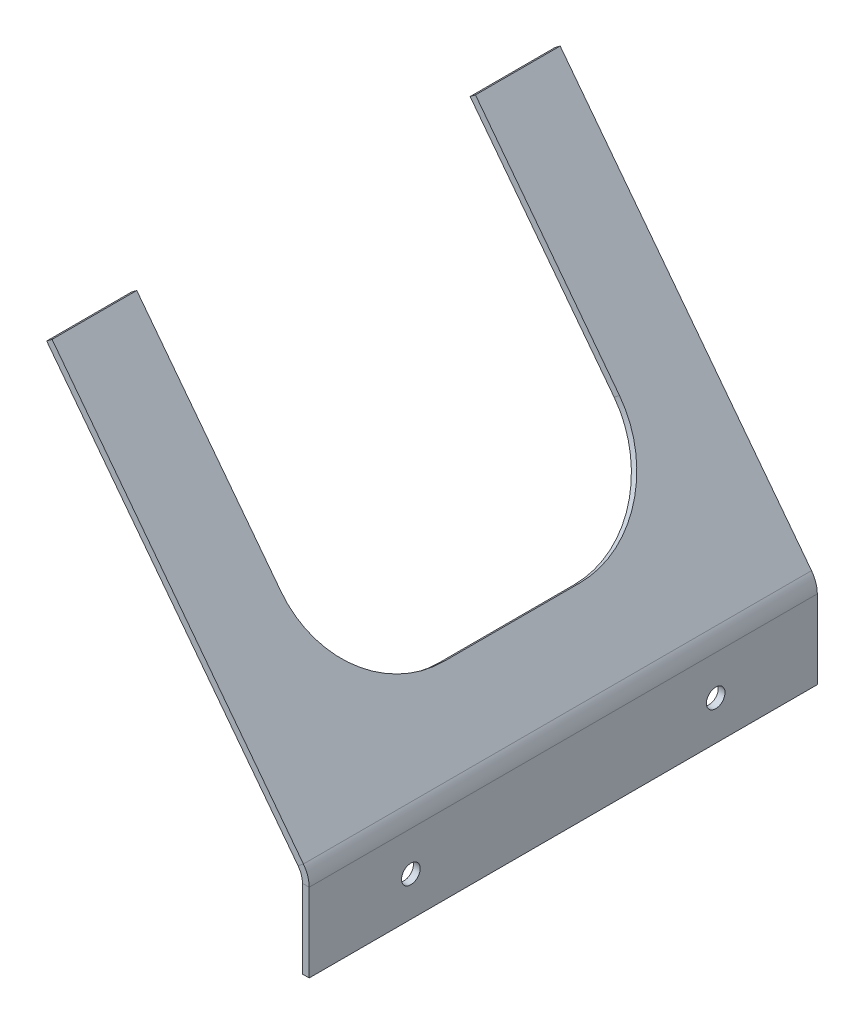
ISO-10303-21;
HEADER;
FILE_DESCRIPTION(('STEP AP214'),'2;1');
FILE_NAME('part.step','',(''),(''),'','','');
FILE_SCHEMA(('AUTOMOTIVE_DESIGN { 1 0 10303 214 1 1 1 1 }'));
ENDSEC;
DATA;
#1=APPLICATION_CONTEXT('core data for automotive mechanical design processes');
#2=APPLICATION_PROTOCOL_DEFINITION('international standard','automotive_design',2000,#1);
#3=PRODUCT_CONTEXT('',#1,'mechanical');
#4=PRODUCT('Part','Part','',(#3));
#5=PRODUCT_RELATED_PRODUCT_CATEGORY('part','',(#4));
#6=PRODUCT_DEFINITION_FORMATION('','',#4);
#7=PRODUCT_DEFINITION_CONTEXT('part definition',#1,'design');
#8=PRODUCT_DEFINITION('design','',#6,#7);
#9=PRODUCT_DEFINITION_SHAPE('','',#8);
#10=(LENGTH_UNIT() NAMED_UNIT(*) SI_UNIT(.MILLI.,.METRE.));
#11=(NAMED_UNIT(*) PLANE_ANGLE_UNIT() SI_UNIT($,.RADIAN.));
#12=(NAMED_UNIT(*) SI_UNIT($,.STERADIAN.) SOLID_ANGLE_UNIT());
#13=UNCERTAINTY_MEASURE_WITH_UNIT(LENGTH_MEASURE(1.E-05),#10,'distance_accuracy_value','');
#14=(GEOMETRIC_REPRESENTATION_CONTEXT(3) GLOBAL_UNCERTAINTY_ASSIGNED_CONTEXT((#13)) GLOBAL_UNIT_ASSIGNED_CONTEXT((#10,
#11,#12)) REPRESENTATION_CONTEXT('',''));
#15=CARTESIAN_POINT('',(0.,0.,0.));
#16=DIRECTION('',(0.,0.,1.));
#17=DIRECTION('',(1.,0.,0.));
#18=AXIS2_PLACEMENT_3D('',#15,#16,#17);
#19=CARTESIAN_POINT('',(1013.55842698651,-572.924346037237,55.));
#20=DIRECTION('',(-0.794371424617198,-0.607432333475626,0.));
#21=DIRECTION('',(0.607432333475626,-0.794371424617198,0.));
#22=AXIS2_PLACEMENT_3D('',#19,#20,#21);
#23=CYLINDRICAL_SURFACE('',#22,30.);
#24=DIRECTION('',(0.794371424617198,0.607432333475626,0.));
#25=VECTOR('',#24,1.);
#26=CARTESIAN_POINT('',(1013.55842698651,-572.924346037237,25.));
#27=LINE('',#26,#25);
#28=CARTESIAN_POINT('',(1005.61471274034,-578.998669371993,25.));
#29=VERTEX_POINT('',#28);
#30=CARTESIAN_POINT('',(1007.20345558957,-577.783804705042,25.));
#31=VERTEX_POINT('',#30);
#32=EDGE_CURVE('E192',#29,#31,#27,.T.);
#33=ORIENTED_EDGE('',*,*,#32,.F.);
#34=CARTESIAN_POINT('',(1005.61471274034,-578.998669371993,55.));
#35=DIRECTION('',(-0.794371424617198,-0.607432333475626,0.));
#36=DIRECTION('',(0.607432333475626,-0.794371424617198,0.));
#37=AXIS2_PLACEMENT_3D('',#34,#35,#36);
#38=CIRCLE('',#37,30.);
#39=CARTESIAN_POINT('',(1023.8376827446,-602.829812110509,55.));
#40=VERTEX_POINT('',#39);
#41=EDGE_CURVE('E48',#29,#40,#38,.T.);
#42=ORIENTED_EDGE('',*,*,#41,.T.);
#43=DIRECTION('',(0.794371424617198,0.607432333475626,0.));
#44=VECTOR('',#43,1.);
#45=CARTESIAN_POINT('',(1031.78139699078,-596.755488775753,55.));
#46=LINE('',#45,#44);
#47=CARTESIAN_POINT('',(1025.42642559384,-601.614947443558,55.));
#48=VERTEX_POINT('',#47);
#49=EDGE_CURVE('E195',#48,#40,#46,.F.);
#50=ORIENTED_EDGE('',*,*,#49,.F.);
#51=CARTESIAN_POINT('',(1007.20345558957,-577.783804705042,55.));
#52=DIRECTION('',(-0.794371424617198,-0.607432333475626,0.));
#53=DIRECTION('',(0.607432333475626,-0.794371424617198,0.));
#54=AXIS2_PLACEMENT_3D('',#51,#52,#53);
#55=CIRCLE('',#54,30.);
#56=EDGE_CURVE('E12',#48,#31,#55,.F.);
#57=ORIENTED_EDGE('',*,*,#56,.T.);
#58=EDGE_LOOP('',(#33,#42,#50,#57));
#59=FACE_BOUND('',#58,.T.);
#60=ADVANCED_FACE('F41',(#59),#23,.F.);
#61=CARTESIAN_POINT('',(1013.55842698651,-572.924346037237,95.));
#62=DIRECTION('',(0.794371424617198,0.607432333475626,0.));
#63=DIRECTION('',(-0.607432333475626,0.794371424617198,0.));
#64=AXIS2_PLACEMENT_3D('',#61,#62,#63);
#65=CYLINDRICAL_SURFACE('',#64,30.);
#66=DIRECTION('',(-0.794371424617198,-0.607432333475626,0.));
#67=VECTOR('',#66,1.);
#68=CARTESIAN_POINT('',(1013.55842698651,-572.924346037237,125.));
#69=LINE('',#68,#67);
#70=CARTESIAN_POINT('',(1007.20345558957,-577.783804705042,125.));
#71=VERTEX_POINT('',#70);
#72=CARTESIAN_POINT('',(1005.61471274034,-578.998669371993,125.));
#73=VERTEX_POINT('',#72);
#74=EDGE_CURVE('E146',#71,#73,#69,.T.);
#75=ORIENTED_EDGE('',*,*,#74,.F.);
#76=CARTESIAN_POINT('',(1007.20345558957,-577.783804705042,95.));
#77=DIRECTION('',(-0.794371424617198,-0.607432333475626,0.));
#78=DIRECTION('',(0.607432333475626,-0.794371424617198,0.));
#79=AXIS2_PLACEMENT_3D('',#76,#77,#78);
#80=CIRCLE('',#79,30.);
#81=CARTESIAN_POINT('',(1025.42642559384,-601.614947443558,95.));
#82=VERTEX_POINT('',#81);
#83=EDGE_CURVE('E187',#71,#82,#80,.F.);
#84=ORIENTED_EDGE('',*,*,#83,.T.);
#85=DIRECTION('',(-0.794371424617198,-0.607432333475626,0.));
#86=VECTOR('',#85,1.);
#87=CARTESIAN_POINT('',(1031.78139699078,-596.755488775753,95.));
#88=LINE('',#87,#86);
#89=CARTESIAN_POINT('',(1023.8376827446,-602.829812110509,95.));
#90=VERTEX_POINT('',#89);
#91=EDGE_CURVE('E184',#90,#82,#88,.F.);
#92=ORIENTED_EDGE('',*,*,#91,.F.);
#93=CARTESIAN_POINT('',(1005.61471274034,-578.998669371993,95.));
#94=DIRECTION('',(-0.794371424617198,-0.607432333475626,0.));
#95=DIRECTION('',(0.607432333475626,-0.794371424617198,0.));
#96=AXIS2_PLACEMENT_3D('',#93,#94,#95);
#97=CIRCLE('',#96,30.);
#98=EDGE_CURVE('E190',#90,#73,#97,.T.);
#99=ORIENTED_EDGE('',*,*,#98,.T.);
#100=EDGE_LOOP('',(#75,#84,#92,#99));
#101=FACE_BOUND('',#100,.T.);
#102=ADVANCED_FACE('F319',(#101),#65,.F.);
#103=CARTESIAN_POINT('',(963.094449397042,-523.392669648789,150.));
#104=DIRECTION('',(-0.607432333475586,0.794371424617228,0.));
#105=DIRECTION('',(-0.794371424617228,-0.607432333475586,0.));
#106=AXIS2_PLACEMENT_3D('',#103,#104,#105);
#107=PLANE('',#106);
#108=DIRECTION('',(-0.794371424617198,-0.607432333475626,0.));
#109=VECTOR('',#108,1.);
#110=CARTESIAN_POINT('',(971.038163643214,-517.318346314033,125.));
#111=LINE('',#110,#109);
#112=CARTESIAN_POINT('',(964.683192246277,-522.177804981838,125.));
#113=VERTEX_POINT('',#112);
#114=CARTESIAN_POINT('',(963.094449397042,-523.392669648789,125.));
#115=VERTEX_POINT('',#114);
#116=EDGE_CURVE('E143',#113,#115,#111,.T.);
#117=ORIENTED_EDGE('',*,*,#116,.T.);
#118=DIRECTION('',(0.,0.,-1.));
#119=VECTOR('',#118,1.);
#120=CARTESIAN_POINT('',(963.094449397042,-523.392669648789,150.));
#121=LINE('',#120,#119);
#122=CARTESIAN_POINT('',(963.094449397042,-523.392669648789,150.));
#123=VERTEX_POINT('',#122);
#124=EDGE_CURVE('E156',#123,#115,#121,.T.);
#125=ORIENTED_EDGE('',*,*,#124,.F.);
#126=DIRECTION('',(0.794371424617228,0.607432333475586,0.));
#127=VECTOR('',#126,1.);
#128=CARTESIAN_POINT('',(963.094449397042,-523.392669648789,150.));
#129=LINE('',#128,#127);
#130=CARTESIAN_POINT('',(964.683192246277,-522.177804981838,150.));
#131=VERTEX_POINT('',#130);
#132=EDGE_CURVE('E218',#123,#131,#129,.T.);
#133=ORIENTED_EDGE('',*,*,#132,.T.);
#134=DIRECTION('',(0.,0.,-1.));
#135=VECTOR('',#134,1.);
#136=CARTESIAN_POINT('',(964.683192246277,-522.177804981838,150.));
#137=LINE('',#136,#135);
#138=EDGE_CURVE('E159',#131,#113,#137,.T.);
#139=ORIENTED_EDGE('',*,*,#138,.T.);
#140=EDGE_LOOP('',(#117,#125,#133,#139));
#141=FACE_BOUND('',#140,.T.);
#142=ADVANCED_FACE('F154',(#141),#107,.T.);
#143=CARTESIAN_POINT('',(1037.29425854632,-620.427688780842,150.));
#144=DIRECTION('',(0.,0.,1.));
#145=DIRECTION('',(1.,0.,0.));
#146=AXIS2_PLACEMENT_3D('',#143,#144,#145);
#147=PLANE('',#146);
#148=DIRECTION('',(0.794371424617228,0.607432333475586,0.));
#149=VECTOR('',#148,1.);
#150=CARTESIAN_POINT('',(1037.29425854632,-620.427688780842,150.));
#151=LINE('',#150,#149);
#152=CARTESIAN_POINT('',(1037.29425854632,-620.427688780842,150.));
#153=VERTEX_POINT('',#152);
#154=CARTESIAN_POINT('',(1038.88300139555,-619.212824113891,150.));
#155=VERTEX_POINT('',#154);
#156=EDGE_CURVE('E181',#153,#155,#151,.T.);
#157=ORIENTED_EDGE('',*,*,#156,.F.);
#158=CARTESIAN_POINT('',(1032.25,-624.284884098413,150.));
#159=DIRECTION('',(0.,0.,-1.));
#160=DIRECTION('',(-1.,0.,0.));
#161=AXIS2_PLACEMENT_3D('',#158,#159,#160);
#162=CIRCLE('',#161,6.35);
#163=CARTESIAN_POINT('',(1038.6,-624.284884098413,150.));
#164=VERTEX_POINT('',#163);
#165=EDGE_CURVE('E222',#164,#153,#162,.F.);
#166=ORIENTED_EDGE('',*,*,#165,.F.);
#167=DIRECTION('',(-1.,0.,0.));
#168=VECTOR('',#167,1.);
#169=CARTESIAN_POINT('',(1040.6,-624.284884098413,150.));
#170=LINE('',#169,#168);
#171=CARTESIAN_POINT('',(1040.6,-624.284884098413,150.));
#172=VERTEX_POINT('',#171);
#173=EDGE_CURVE('E179',#172,#164,#170,.T.);
#174=ORIENTED_EDGE('',*,*,#173,.F.);
#175=CARTESIAN_POINT('',(1032.25,-624.284884098413,150.));
#176=DIRECTION('',(0.,0.,1.));
#177=DIRECTION('',(1.,0.,0.));
#178=AXIS2_PLACEMENT_3D('',#175,#176,#177);
#179=CIRCLE('',#178,8.35);
#180=EDGE_CURVE('E234',#172,#155,#179,.T.);
#181=ORIENTED_EDGE('',*,*,#180,.T.);
#182=EDGE_LOOP('',(#157,#166,#174,#181));
#183=FACE_BOUND('',#182,.T.);
#184=ADVANCED_FACE('F299',(#183),#147,.T.);
#185=CARTESIAN_POINT('',(1040.6,-624.284884098413,150.));
#186=DIRECTION('',(0.,0.,1.));
#187=DIRECTION('',(1.,0.,0.));
#188=AXIS2_PLACEMENT_3D('',#185,#186,#187);
#189=PLANE('',#188);
#190=DIRECTION('',(-0.607432333475626,0.794371424617198,0.));
#191=VECTOR('',#190,1.);
#192=CARTESIAN_POINT('',(1038.6,-622.135276015798,150.));
#193=LINE('',#192,#191);
#194=EDGE_CURVE('E166',#153,#123,#193,.T.);
#195=ORIENTED_EDGE('',*,*,#194,.F.);
#196=ORIENTED_EDGE('',*,*,#156,.T.);
#197=DIRECTION('',(-0.607432333475626,0.794371424617198,0.));
#198=VECTOR('',#197,1.);
#199=CARTESIAN_POINT('',(1040.18874284923,-620.920411348847,150.));
#200=LINE('',#199,#198);
#201=EDGE_CURVE('E216',#155,#131,#200,.T.);
#202=ORIENTED_EDGE('',*,*,#201,.T.);
#203=ORIENTED_EDGE('',*,*,#132,.F.);
#204=EDGE_LOOP('',(#195,#196,#202,#203));
#205=FACE_BOUND('',#204,.T.);
#206=ADVANCED_FACE('F334',(#205),#189,.T.);
#207=CARTESIAN_POINT('',(1038.6,-624.284884098413,0.));
#208=DIRECTION('',(0.,0.,-1.));
#209=DIRECTION('',(-1.,0.,0.));
#210=AXIS2_PLACEMENT_3D('',#207,#208,#209);
#211=PLANE('',#210);
#212=DIRECTION('',(1.,0.,0.));
#213=VECTOR('',#212,1.);
#214=CARTESIAN_POINT('',(1038.6,-624.284884098413,0.));
#215=LINE('',#214,#213);
#216=CARTESIAN_POINT('',(1038.6,-624.284884098413,0.));
#217=VERTEX_POINT('',#216);
#218=CARTESIAN_POINT('',(1040.6,-624.284884098413,0.));
#219=VERTEX_POINT('',#218);
#220=EDGE_CURVE('E177',#217,#219,#215,.T.);
#221=ORIENTED_EDGE('',*,*,#220,.F.);
#222=CARTESIAN_POINT('',(1032.25,-624.284884098413,0.));
#223=DIRECTION('',(0.,0.,-1.));
#224=DIRECTION('',(-1.,0.,0.));
#225=AXIS2_PLACEMENT_3D('',#222,#223,#224);
#226=CIRCLE('',#225,6.35);
#227=CARTESIAN_POINT('',(1037.29425854632,-620.427688780842,0.));
#228=VERTEX_POINT('',#227);
#229=EDGE_CURVE('E246',#217,#228,#226,.F.);
#230=ORIENTED_EDGE('',*,*,#229,.T.);
#231=DIRECTION('',(-0.794371424617228,-0.607432333475586,0.));
#232=VECTOR('',#231,1.);
#233=CARTESIAN_POINT('',(1038.88300139555,-619.212824113891,0.));
#234=LINE('',#233,#232);
#235=CARTESIAN_POINT('',(1038.88300139555,-619.212824113891,0.));
#236=VERTEX_POINT('',#235);
#237=EDGE_CURVE('E175',#236,#228,#234,.T.);
#238=ORIENTED_EDGE('',*,*,#237,.F.);
#239=CARTESIAN_POINT('',(1032.25,-624.284884098413,0.));
#240=DIRECTION('',(0.,0.,1.));
#241=DIRECTION('',(1.,0.,0.));
#242=AXIS2_PLACEMENT_3D('',#239,#240,#241);
#243=CIRCLE('',#242,8.35);
#244=EDGE_CURVE('E219',#219,#236,#243,.T.);
#245=ORIENTED_EDGE('',*,*,#244,.F.);
#246=EDGE_LOOP('',(#221,#230,#238,#245));
#247=FACE_BOUND('',#246,.T.);
#248=ADVANCED_FACE('F283',(#247),#211,.T.);
#249=CARTESIAN_POINT('',(1038.88300139555,-619.212824113891,0.));
#250=DIRECTION('',(0.,0.,-1.));
#251=DIRECTION('',(-1.,0.,0.));
#252=AXIS2_PLACEMENT_3D('',#249,#250,#251);
#253=PLANE('',#252);
#254=DIRECTION('',(0.,1.,0.));
#255=VECTOR('',#254,1.);
#256=CARTESIAN_POINT('',(1038.6,-647.5,0.));
#257=LINE('',#256,#255);
#258=CARTESIAN_POINT('',(1038.6,-647.5,0.));
#259=VERTEX_POINT('',#258);
#260=EDGE_CURVE('E249',#259,#217,#257,.T.);
#261=ORIENTED_EDGE('',*,*,#260,.T.);
#262=ORIENTED_EDGE('',*,*,#220,.T.);
#263=DIRECTION('',(0.,1.,0.));
#264=VECTOR('',#263,1.);
#265=CARTESIAN_POINT('',(1040.6,-647.5,0.));
#266=LINE('',#265,#264);
#267=CARTESIAN_POINT('',(1040.6,-647.5,0.));
#268=VERTEX_POINT('',#267);
#269=EDGE_CURVE('E255',#268,#219,#266,.T.);
#270=ORIENTED_EDGE('',*,*,#269,.F.);
#271=DIRECTION('',(-1.,0.,0.));
#272=VECTOR('',#271,1.);
#273=CARTESIAN_POINT('',(1040.6,-647.5,0.));
#274=LINE('',#273,#272);
#275=EDGE_CURVE('E252',#268,#259,#274,.T.);
#276=ORIENTED_EDGE('',*,*,#275,.T.);
#277=EDGE_LOOP('',(#261,#262,#270,#276));
#278=FACE_BOUND('',#277,.T.);
#279=ADVANCED_FACE('F287',(#278),#253,.T.);
#280=CARTESIAN_POINT('',(1040.18874284923,-620.920411348847,150.));
#281=DIRECTION('',(-0.794371424617198,-0.607432333475626,0.));
#282=DIRECTION('',(0.607432333475626,-0.794371424617198,0.));
#283=AXIS2_PLACEMENT_3D('',#280,#281,#282);
#284=PLANE('',#283);
#285=ORIENTED_EDGE('',*,*,#56,.F.);
#286=DIRECTION('',(0.,0.,1.));
#287=VECTOR('',#286,1.);
#288=CARTESIAN_POINT('',(1025.42642559384,-601.614947443558,150.));
#289=LINE('',#288,#287);
#290=EDGE_CURVE('E200',#48,#82,#289,.T.);
#291=ORIENTED_EDGE('',*,*,#290,.T.);
#292=ORIENTED_EDGE('',*,*,#83,.F.);
#293=DIRECTION('',(-0.607432333475626,0.794371424617198,0.));
#294=VECTOR('',#293,1.);
#295=CARTESIAN_POINT('',(1040.18874284923,-620.920411348847,125.));
#296=LINE('',#295,#294);
#297=EDGE_CURVE('E213',#71,#113,#296,.T.);
#298=ORIENTED_EDGE('',*,*,#297,.T.);
#299=ORIENTED_EDGE('',*,*,#138,.F.);
#300=ORIENTED_EDGE('',*,*,#201,.F.);
#301=DIRECTION('',(0.,0.,-1.));
#302=VECTOR('',#301,1.);
#303=CARTESIAN_POINT('',(1038.88300139555,-619.212824113891,150.));
#304=LINE('',#303,#302);
#305=EDGE_CURVE('E237',#155,#236,#304,.T.);
#306=ORIENTED_EDGE('',*,*,#305,.T.);
#307=DIRECTION('',(-0.607432333475626,0.794371424617198,0.));
#308=VECTOR('',#307,1.);
#309=CARTESIAN_POINT('',(1040.18874284923,-620.920411348847,0.));
#310=LINE('',#309,#308);
#311=CARTESIAN_POINT('',(964.683192246277,-522.177804981838,0.));
#312=VERTEX_POINT('',#311);
#313=EDGE_CURVE('E215',#236,#312,#310,.T.);
#314=ORIENTED_EDGE('',*,*,#313,.T.);
#315=CARTESIAN_POINT('',(964.683192246277,-522.177804981838,25.));
#316=VERTEX_POINT('',#315);
#317=EDGE_CURVE('E167',#316,#312,#137,.T.);
#318=ORIENTED_EDGE('',*,*,#317,.F.);
#319=DIRECTION('',(0.607432333475626,-0.794371424617198,0.));
#320=VECTOR('',#319,1.);
#321=CARTESIAN_POINT('',(1040.18874284923,-620.920411348847,25.));
#322=LINE('',#321,#320);
#323=EDGE_CURVE('E160',#316,#31,#322,.T.);
#324=ORIENTED_EDGE('',*,*,#323,.T.);
#325=EDGE_LOOP('',(#285,#291,#292,#298,#299,#300,#306,#314,#318,#324));
#326=FACE_BOUND('',#325,.T.);
#327=ADVANCED_FACE('F332',(#326),#284,.F.);
#328=DIRECTION('',(-0.794371424617198,-0.607432333475626,0.));
#329=VECTOR('',#328,1.);
#330=CARTESIAN_POINT('',(971.038163643214,-517.318346314033,25.));
#331=LINE('',#330,#329);
#332=CARTESIAN_POINT('',(963.094449397042,-523.392669648789,25.));
#333=VERTEX_POINT('',#332);
#334=EDGE_CURVE('E150',#316,#333,#331,.T.);
#335=ORIENTED_EDGE('',*,*,#334,.F.);
#336=ORIENTED_EDGE('',*,*,#317,.T.);
#337=DIRECTION('',(0.794371424617228,0.607432333475586,0.));
#338=VECTOR('',#337,1.);
#339=CARTESIAN_POINT('',(963.094449397042,-523.392669648789,0.));
#340=LINE('',#339,#338);
#341=CARTESIAN_POINT('',(963.094449397042,-523.392669648789,0.));
#342=VERTEX_POINT('',#341);
#343=EDGE_CURVE('E240',#342,#312,#340,.T.);
#344=ORIENTED_EDGE('',*,*,#343,.F.);
#345=EDGE_CURVE('E168',#333,#342,#121,.T.);
#346=ORIENTED_EDGE('',*,*,#345,.F.);
#347=EDGE_LOOP('',(#335,#336,#344,#346));
#348=FACE_BOUND('',#347,.T.);
#349=ADVANCED_FACE('F328',(#348),#107,.T.);
#350=CARTESIAN_POINT('',(1038.6,-622.135276015798,150.));
#351=DIRECTION('',(-0.794371424617198,-0.607432333475626,0.));
#352=DIRECTION('',(0.607432333475626,-0.794371424617198,0.));
#353=AXIS2_PLACEMENT_3D('',#350,#351,#352);
#354=PLANE('',#353);
#355=DIRECTION('',(-0.607432333475626,0.794371424617197,0.));
#356=VECTOR('',#355,1.);
#357=CARTESIAN_POINT('',(963.094449397042,-523.392669648789,125.));
#358=LINE('',#357,#356);
#359=EDGE_CURVE('E139',#73,#115,#358,.T.);
#360=ORIENTED_EDGE('',*,*,#359,.F.);
#361=ORIENTED_EDGE('',*,*,#98,.F.);
#362=DIRECTION('',(0.,0.,1.));
#363=VECTOR('',#362,1.);
#364=CARTESIAN_POINT('',(1023.8376827446,-602.829812110509,125.));
#365=LINE('',#364,#363);
#366=EDGE_CURVE('E151',#40,#90,#365,.T.);
#367=ORIENTED_EDGE('',*,*,#366,.F.);
#368=ORIENTED_EDGE('',*,*,#41,.F.);
#369=DIRECTION('',(0.607432333475626,-0.794371424617197,0.));
#370=VECTOR('',#369,1.);
#371=CARTESIAN_POINT('',(1023.8376827446,-602.829812110509,25.));
#372=LINE('',#371,#370);
#373=EDGE_CURVE('E203',#333,#29,#372,.T.);
#374=ORIENTED_EDGE('',*,*,#373,.F.);
#375=ORIENTED_EDGE('',*,*,#345,.T.);
#376=DIRECTION('',(-0.607432333475626,0.794371424617198,0.));
#377=VECTOR('',#376,1.);
#378=CARTESIAN_POINT('',(1038.6,-622.135276015798,0.));
#379=LINE('',#378,#377);
#380=EDGE_CURVE('E243',#228,#342,#379,.T.);
#381=ORIENTED_EDGE('',*,*,#380,.F.);
#382=DIRECTION('',(0.,0.,-1.));
#383=VECTOR('',#382,1.);
#384=CARTESIAN_POINT('',(1037.29425854632,-620.427688780842,150.));
#385=LINE('',#384,#383);
#386=EDGE_CURVE('E171',#153,#228,#385,.T.);
#387=ORIENTED_EDGE('',*,*,#386,.F.);
#388=ORIENTED_EDGE('',*,*,#194,.T.);
#389=ORIENTED_EDGE('',*,*,#124,.T.);
#390=EDGE_LOOP('',(#360,#361,#367,#368,#374,#375,#381,#387,#388,#389));
#391=FACE_BOUND('',#390,.T.);
#392=ADVANCED_FACE('F163',(#391),#354,.T.);
#393=CARTESIAN_POINT('',(1032.25,-624.284884098413,150.));
#394=DIRECTION('',(0.,0.,-1.));
#395=DIRECTION('',(-1.,0.,0.));
#396=AXIS2_PLACEMENT_3D('',#393,#394,#395);
#397=CYLINDRICAL_SURFACE('',#396,6.35);
#398=ORIENTED_EDGE('',*,*,#229,.F.);
#399=DIRECTION('',(0.,0.,-1.));
#400=VECTOR('',#399,1.);
#401=CARTESIAN_POINT('',(1038.6,-624.284884098413,150.));
#402=LINE('',#401,#400);
#403=EDGE_CURVE('E268',#164,#217,#402,.T.);
#404=ORIENTED_EDGE('',*,*,#403,.F.);
#405=ORIENTED_EDGE('',*,*,#165,.T.);
#406=ORIENTED_EDGE('',*,*,#386,.T.);
#407=EDGE_LOOP('',(#398,#404,#405,#406));
#408=FACE_BOUND('',#407,.T.);
#409=ADVANCED_FACE('F277',(#408),#397,.F.);
#410=CARTESIAN_POINT('',(1038.6,-647.5,150.));
#411=DIRECTION('',(-1.,0.,0.));
#412=DIRECTION('',(0.,-1.,0.));
#413=AXIS2_PLACEMENT_3D('',#410,#411,#412);
#414=PLANE('',#413);
#415=CARTESIAN_POINT('',(1038.6,-635.892442049206,30.));
#416=DIRECTION('',(-1.,0.,0.));
#417=DIRECTION('',(0.,-1.,0.));
#418=AXIS2_PLACEMENT_3D('',#415,#416,#417);
#419=CIRCLE('',#418,2.75000000000003);
#420=CARTESIAN_POINT('',(1038.6,-638.642442049206,30.));
#421=VERTEX_POINT('',#420);
#422=EDGE_CURVE('E537',#421,#421,#419,.T.);
#423=ORIENTED_EDGE('',*,*,#422,.F.);
#424=EDGE_LOOP('',(#423));
#425=FACE_BOUND('',#424,.T.);
#426=CARTESIAN_POINT('',(1038.6,-635.892442049206,120.));
#427=DIRECTION('',(-1.,0.,0.));
#428=DIRECTION('',(0.,-1.,0.));
#429=AXIS2_PLACEMENT_3D('',#426,#427,#428);
#430=CIRCLE('',#429,2.75000000000003);
#431=CARTESIAN_POINT('',(1038.6,-638.642442049206,120.));
#432=VERTEX_POINT('',#431);
#433=EDGE_CURVE('E206',#432,#432,#430,.T.);
#434=ORIENTED_EDGE('',*,*,#433,.F.);
#435=EDGE_LOOP('',(#434));
#436=FACE_BOUND('',#435,.T.);
#437=ORIENTED_EDGE('',*,*,#260,.F.);
#438=DIRECTION('',(0.,0.,-1.));
#439=VECTOR('',#438,1.);
#440=CARTESIAN_POINT('',(1038.6,-647.5,150.));
#441=LINE('',#440,#439);
#442=CARTESIAN_POINT('',(1038.6,-647.5,150.));
#443=VERTEX_POINT('',#442);
#444=EDGE_CURVE('E267',#443,#259,#441,.T.);
#445=ORIENTED_EDGE('',*,*,#444,.F.);
#446=DIRECTION('',(0.,1.,0.));
#447=VECTOR('',#446,1.);
#448=CARTESIAN_POINT('',(1038.6,-647.5,150.));
#449=LINE('',#448,#447);
#450=EDGE_CURVE('E225',#443,#164,#449,.T.);
#451=ORIENTED_EDGE('',*,*,#450,.T.);
#452=ORIENTED_EDGE('',*,*,#403,.T.);
#453=EDGE_LOOP('',(#437,#445,#451,#452));
#454=FACE_BOUND('',#453,.T.);
#455=ADVANCED_FACE('F306',(#425,#436,#454),#414,.T.);
#456=CARTESIAN_POINT('',(1040.6,-647.5,150.));
#457=DIRECTION('',(0.,-1.,0.));
#458=DIRECTION('',(0.,0.,-1.));
#459=AXIS2_PLACEMENT_3D('',#456,#457,#458);
#460=PLANE('',#459);
#461=ORIENTED_EDGE('',*,*,#275,.F.);
#462=DIRECTION('',(0.,0.,-1.));
#463=VECTOR('',#462,1.);
#464=CARTESIAN_POINT('',(1040.6,-647.5,150.));
#465=LINE('',#464,#463);
#466=CARTESIAN_POINT('',(1040.6,-647.5,150.));
#467=VERTEX_POINT('',#466);
#468=EDGE_CURVE('E265',#467,#268,#465,.T.);
#469=ORIENTED_EDGE('',*,*,#468,.F.);
#470=DIRECTION('',(-1.,0.,0.));
#471=VECTOR('',#470,1.);
#472=CARTESIAN_POINT('',(1040.6,-647.5,150.));
#473=LINE('',#472,#471);
#474=EDGE_CURVE('E228',#467,#443,#473,.T.);
#475=ORIENTED_EDGE('',*,*,#474,.T.);
#476=ORIENTED_EDGE('',*,*,#444,.T.);
#477=EDGE_LOOP('',(#461,#469,#475,#476));
#478=FACE_BOUND('',#477,.T.);
#479=ADVANCED_FACE('F305',(#478),#460,.T.);
#480=CARTESIAN_POINT('',(1040.6,-647.5,150.));
#481=DIRECTION('',(-1.,0.,0.));
#482=DIRECTION('',(0.,-1.,0.));
#483=AXIS2_PLACEMENT_3D('',#480,#481,#482);
#484=PLANE('',#483);
#485=CARTESIAN_POINT('',(1040.6,-635.892442049206,30.));
#486=DIRECTION('',(1.,0.,0.));
#487=DIRECTION('',(0.,0.,-1.));
#488=AXIS2_PLACEMENT_3D('',#485,#486,#487);
#489=CIRCLE('',#488,2.75000000000003);
#490=CARTESIAN_POINT('',(1040.6,-635.892442049206,27.25));
#491=VERTEX_POINT('',#490);
#492=EDGE_CURVE('E540',#491,#491,#489,.T.);
#493=ORIENTED_EDGE('',*,*,#492,.F.);
#494=EDGE_LOOP('',(#493));
#495=FACE_BOUND('',#494,.T.);
#496=CARTESIAN_POINT('',(1040.6,-635.892442049206,120.));
#497=DIRECTION('',(1.,0.,0.));
#498=DIRECTION('',(0.,0.,-1.));
#499=AXIS2_PLACEMENT_3D('',#496,#497,#498);
#500=CIRCLE('',#499,2.75000000000003);
#501=CARTESIAN_POINT('',(1040.6,-635.892442049206,117.25));
#502=VERTEX_POINT('',#501);
#503=EDGE_CURVE('E542',#502,#502,#500,.T.);
#504=ORIENTED_EDGE('',*,*,#503,.F.);
#505=EDGE_LOOP('',(#504));
#506=FACE_BOUND('',#505,.T.);
#507=ORIENTED_EDGE('',*,*,#269,.T.);
#508=DIRECTION('',(0.,0.,-1.));
#509=VECTOR('',#508,1.);
#510=CARTESIAN_POINT('',(1040.6,-624.284884098413,150.));
#511=LINE('',#510,#509);
#512=EDGE_CURVE('E262',#172,#219,#511,.T.);
#513=ORIENTED_EDGE('',*,*,#512,.F.);
#514=DIRECTION('',(0.,1.,0.));
#515=VECTOR('',#514,1.);
#516=CARTESIAN_POINT('',(1040.6,-647.5,150.));
#517=LINE('',#516,#515);
#518=EDGE_CURVE('E231',#467,#172,#517,.T.);
#519=ORIENTED_EDGE('',*,*,#518,.F.);
#520=ORIENTED_EDGE('',*,*,#468,.T.);
#521=EDGE_LOOP('',(#507,#513,#519,#520));
#522=FACE_BOUND('',#521,.T.);
#523=ADVANCED_FACE('F291',(#495,#506,#522),#484,.F.);
#524=CARTESIAN_POINT('',(1032.25,-624.284884098413,150.));
#525=DIRECTION('',(0.,0.,-1.));
#526=DIRECTION('',(-1.,0.,0.));
#527=AXIS2_PLACEMENT_3D('',#524,#525,#526);
#528=CYLINDRICAL_SURFACE('',#527,8.35);
#529=ORIENTED_EDGE('',*,*,#244,.T.);
#530=ORIENTED_EDGE('',*,*,#305,.F.);
#531=ORIENTED_EDGE('',*,*,#180,.F.);
#532=ORIENTED_EDGE('',*,*,#512,.T.);
#533=EDGE_LOOP('',(#529,#530,#531,#532));
#534=FACE_BOUND('',#533,.T.);
#535=ADVANCED_FACE('F295',(#534),#528,.T.);
#536=CARTESIAN_POINT('',(1032.25,-624.284884098413,150.));
#537=DIRECTION('',(0.,0.,-1.));
#538=DIRECTION('',(-1.,0.,0.));
#539=AXIS2_PLACEMENT_3D('',#536,#537,#538);
#540=PLANE('',#539);
#541=ORIENTED_EDGE('',*,*,#518,.T.);
#542=ORIENTED_EDGE('',*,*,#173,.T.);
#543=ORIENTED_EDGE('',*,*,#450,.F.);
#544=ORIENTED_EDGE('',*,*,#474,.F.);
#545=EDGE_LOOP('',(#541,#542,#543,#544));
#546=FACE_BOUND('',#545,.T.);
#547=ADVANCED_FACE('F303',(#546),#540,.F.);
#548=CARTESIAN_POINT('',(1032.25,-624.284884098413,0.));
#549=DIRECTION('',(0.,0.,-1.));
#550=DIRECTION('',(-1.,0.,0.));
#551=AXIS2_PLACEMENT_3D('',#548,#549,#550);
#552=PLANE('',#551);
#553=ORIENTED_EDGE('',*,*,#313,.F.);
#554=ORIENTED_EDGE('',*,*,#237,.T.);
#555=ORIENTED_EDGE('',*,*,#380,.T.);
#556=ORIENTED_EDGE('',*,*,#343,.T.);
#557=EDGE_LOOP('',(#553,#554,#555,#556));
#558=FACE_BOUND('',#557,.T.);
#559=ADVANCED_FACE('F331',(#558),#552,.T.);
#560=CARTESIAN_POINT('',(971.038163643214,-517.318346314033,125.));
#561=DIRECTION('',(0.,0.,1.));
#562=DIRECTION('',(1.,0.,0.));
#563=AXIS2_PLACEMENT_3D('',#560,#561,#562);
#564=PLANE('',#563);
#565=ORIENTED_EDGE('',*,*,#297,.F.);
#566=ORIENTED_EDGE('',*,*,#74,.T.);
#567=ORIENTED_EDGE('',*,*,#359,.T.);
#568=ORIENTED_EDGE('',*,*,#116,.F.);
#569=EDGE_LOOP('',(#565,#566,#567,#568));
#570=FACE_BOUND('',#569,.T.);
#571=ADVANCED_FACE('F142',(#570),#564,.F.);
#572=CARTESIAN_POINT('',(1031.78139699078,-596.755488775753,125.));
#573=DIRECTION('',(0.607432333475626,-0.794371424617198,0.));
#574=DIRECTION('',(0.794371424617198,0.607432333475626,0.));
#575=AXIS2_PLACEMENT_3D('',#572,#573,#574);
#576=PLANE('',#575);
#577=ORIENTED_EDGE('',*,*,#290,.F.);
#578=ORIENTED_EDGE('',*,*,#49,.T.);
#579=ORIENTED_EDGE('',*,*,#366,.T.);
#580=ORIENTED_EDGE('',*,*,#91,.T.);
#581=EDGE_LOOP('',(#577,#578,#579,#580));
#582=FACE_BOUND('',#581,.T.);
#583=ADVANCED_FACE('F199',(#582),#576,.F.);
#584=CARTESIAN_POINT('',(1031.78139699078,-596.755488775753,25.));
#585=DIRECTION('',(0.,0.,-1.));
#586=DIRECTION('',(-1.,0.,0.));
#587=AXIS2_PLACEMENT_3D('',#584,#585,#586);
#588=PLANE('',#587);
#589=ORIENTED_EDGE('',*,*,#373,.T.);
#590=ORIENTED_EDGE('',*,*,#32,.T.);
#591=ORIENTED_EDGE('',*,*,#323,.F.);
#592=ORIENTED_EDGE('',*,*,#334,.T.);
#593=EDGE_LOOP('',(#589,#590,#591,#592));
#594=FACE_BOUND('',#593,.T.);
#595=ADVANCED_FACE('F325',(#594),#588,.F.);
#596=CARTESIAN_POINT('',(1040.6,-635.892442049206,120.));
#597=DIRECTION('',(1.,0.,0.));
#598=DIRECTION('',(0.,0.,-1.));
#599=AXIS2_PLACEMENT_3D('',#596,#597,#598);
#600=CYLINDRICAL_SURFACE('',#599,2.75000000000003);
#601=ORIENTED_EDGE('',*,*,#433,.T.);
#602=EDGE_LOOP('',(#601));
#603=FACE_BOUND('',#602,.T.);
#604=ORIENTED_EDGE('',*,*,#503,.T.);
#605=EDGE_LOOP('',(#604));
#606=FACE_BOUND('',#605,.T.);
#607=ADVANCED_FACE('F503',(#603,#606),#600,.F.);
#608=CARTESIAN_POINT('',(1040.6,-635.892442049206,30.));
#609=DIRECTION('',(1.,0.,0.));
#610=DIRECTION('',(0.,0.,-1.));
#611=AXIS2_PLACEMENT_3D('',#608,#609,#610);
#612=CYLINDRICAL_SURFACE('',#611,2.75000000000003);
#613=ORIENTED_EDGE('',*,*,#422,.T.);
#614=EDGE_LOOP('',(#613));
#615=FACE_BOUND('',#614,.T.);
#616=ORIENTED_EDGE('',*,*,#492,.T.);
#617=EDGE_LOOP('',(#616));
#618=FACE_BOUND('',#617,.T.);
#619=ADVANCED_FACE('F507',(#615,#618),#612,.F.);
#620=CLOSED_SHELL('',(#60,#102,#142,#184,#206,#248,#279,#327,#349,#392,#409,#455,#479,#523,#535,
#547,#559,#571,#583,#595,#607,#619));
#621=MANIFOLD_SOLID_BREP('B2',#620);
#622=ADVANCED_BREP_SHAPE_REPRESENTATION('',(#18,#621),#14);
#623=SHAPE_DEFINITION_REPRESENTATION(#9,#622);
ENDSEC;
END-ISO-10303-21;
